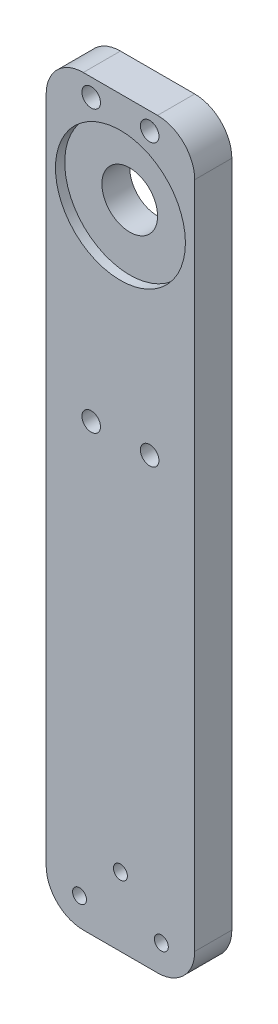
ISO-10303-21;
HEADER;
FILE_DESCRIPTION(('STEP AP214'),'2;1');
FILE_NAME('part.step','',(''),(''),'','','');
FILE_SCHEMA(('AUTOMOTIVE_DESIGN { 1 0 10303 214 1 1 1 1 }'));
ENDSEC;
DATA;
#1=APPLICATION_CONTEXT('core data for automotive mechanical design processes');
#2=APPLICATION_PROTOCOL_DEFINITION('international standard','automotive_design',2000,#1);
#3=PRODUCT_CONTEXT('',#1,'mechanical');
#4=PRODUCT('Part','Part','',(#3));
#5=PRODUCT_RELATED_PRODUCT_CATEGORY('part','',(#4));
#6=PRODUCT_DEFINITION_FORMATION('','',#4);
#7=PRODUCT_DEFINITION_CONTEXT('part definition',#1,'design');
#8=PRODUCT_DEFINITION('design','',#6,#7);
#9=PRODUCT_DEFINITION_SHAPE('','',#8);
#10=(LENGTH_UNIT() NAMED_UNIT(*) SI_UNIT(.MILLI.,.METRE.));
#11=(NAMED_UNIT(*) PLANE_ANGLE_UNIT() SI_UNIT($,.RADIAN.));
#12=(NAMED_UNIT(*) SI_UNIT($,.STERADIAN.) SOLID_ANGLE_UNIT());
#13=UNCERTAINTY_MEASURE_WITH_UNIT(LENGTH_MEASURE(1.E-05),#10,'distance_accuracy_value','');
#14=(GEOMETRIC_REPRESENTATION_CONTEXT(3) GLOBAL_UNCERTAINTY_ASSIGNED_CONTEXT((#13)) GLOBAL_UNIT_ASSIGNED_CONTEXT((#10,
#11,#12)) REPRESENTATION_CONTEXT('',''));
#15=CARTESIAN_POINT('',(0.,0.,0.));
#16=DIRECTION('',(0.,0.,1.));
#17=DIRECTION('',(1.,0.,0.));
#18=AXIS2_PLACEMENT_3D('',#15,#16,#17);
#19=CARTESIAN_POINT('',(12.7,110.499906,-13.4703841816037));
#20=DIRECTION('',(0.,0.,1.));
#21=DIRECTION('',(1.,0.,0.));
#22=AXIS2_PLACEMENT_3D('',#19,#20,#21);
#23=CYLINDRICAL_SURFACE('',#22,4.7625);
#24=CARTESIAN_POINT('',(12.7,110.499906,0.));
#25=DIRECTION('',(0.,0.,-1.));
#26=DIRECTION('',(-1.,0.,0.));
#27=AXIS2_PLACEMENT_3D('',#24,#25,#26);
#28=CIRCLE('',#27,4.7625);
#29=CARTESIAN_POINT('',(7.9375,110.499906,0.));
#30=VERTEX_POINT('',#29);
#31=EDGE_CURVE('E191',#30,#30,#28,.F.);
#32=ORIENTED_EDGE('',*,*,#31,.F.);
#33=EDGE_LOOP('',(#32));
#34=FACE_BOUND('',#33,.T.);
#35=CARTESIAN_POINT('',(12.7,110.499906,4.7625));
#36=DIRECTION('',(0.,0.,1.));
#37=DIRECTION('',(1.,0.,0.));
#38=AXIS2_PLACEMENT_3D('',#35,#36,#37);
#39=CIRCLE('',#38,4.7625);
#40=CARTESIAN_POINT('',(17.4625,110.499906,4.7625));
#41=VERTEX_POINT('',#40);
#42=EDGE_CURVE('E36',#41,#41,#39,.F.);
#43=ORIENTED_EDGE('',*,*,#42,.F.);
#44=EDGE_LOOP('',(#43));
#45=FACE_BOUND('',#44,.T.);
#46=ADVANCED_FACE('F32',(#34,#45),#23,.F.);
#47=CARTESIAN_POINT('',(0.,0.,6.35));
#48=DIRECTION('',(1.,0.,0.));
#49=DIRECTION('',(0.,0.,-1.));
#50=AXIS2_PLACEMENT_3D('',#47,#48,#49);
#51=PLANE('',#50);
#52=DIRECTION('',(0.,-1.,0.));
#53=VECTOR('',#52,1.);
#54=CARTESIAN_POINT('',(0.,0.,6.35));
#55=LINE('',#54,#53);
#56=CARTESIAN_POINT('',(0.,120.65,6.35));
#57=VERTEX_POINT('',#56);
#58=CARTESIAN_POINT('',(0.,6.35,6.35));
#59=VERTEX_POINT('',#58);
#60=EDGE_CURVE('E135',#57,#59,#55,.T.);
#61=ORIENTED_EDGE('',*,*,#60,.F.);
#62=DIRECTION('',(0.,0.,-1.));
#63=VECTOR('',#62,1.);
#64=CARTESIAN_POINT('',(0.,120.65,6.35));
#65=LINE('',#64,#63);
#66=CARTESIAN_POINT('',(0.,120.65,0.));
#67=VERTEX_POINT('',#66);
#68=EDGE_CURVE('E147',#57,#67,#65,.T.);
#69=ORIENTED_EDGE('',*,*,#68,.T.);
#70=DIRECTION('',(0.,-1.,0.));
#71=VECTOR('',#70,1.);
#72=CARTESIAN_POINT('',(0.,0.,0.));
#73=LINE('',#72,#71);
#74=CARTESIAN_POINT('',(0.,6.35,0.));
#75=VERTEX_POINT('',#74);
#76=EDGE_CURVE('E126',#67,#75,#73,.T.);
#77=ORIENTED_EDGE('',*,*,#76,.T.);
#78=DIRECTION('',(0.,0.,-1.));
#79=VECTOR('',#78,1.);
#80=CARTESIAN_POINT('',(0.,6.35,6.35));
#81=LINE('',#80,#79);
#82=EDGE_CURVE('E107',#75,#59,#81,.F.);
#83=ORIENTED_EDGE('',*,*,#82,.T.);
#84=EDGE_LOOP('',(#61,#69,#77,#83));
#85=FACE_BOUND('',#84,.T.);
#86=ADVANCED_FACE('F167',(#85),#51,.F.);
#87=CARTESIAN_POINT('',(0.,0.,6.35));
#88=DIRECTION('',(0.,1.,0.));
#89=DIRECTION('',(0.,0.,1.));
#90=AXIS2_PLACEMENT_3D('',#87,#88,#89);
#91=PLANE('',#90);
#92=DIRECTION('',(1.,0.,0.));
#93=VECTOR('',#92,1.);
#94=CARTESIAN_POINT('',(0.,0.,6.35));
#95=LINE('',#94,#93);
#96=CARTESIAN_POINT('',(6.35,0.,6.35));
#97=VERTEX_POINT('',#96);
#98=CARTESIAN_POINT('',(19.05,0.,6.35));
#99=VERTEX_POINT('',#98);
#100=EDGE_CURVE('E120',#97,#99,#95,.T.);
#101=ORIENTED_EDGE('',*,*,#100,.F.);
#102=DIRECTION('',(0.,0.,-1.));
#103=VECTOR('',#102,1.);
#104=CARTESIAN_POINT('',(6.35,0.,6.35));
#105=LINE('',#104,#103);
#106=CARTESIAN_POINT('',(6.35,0.,0.));
#107=VERTEX_POINT('',#106);
#108=EDGE_CURVE('E105',#97,#107,#105,.T.);
#109=ORIENTED_EDGE('',*,*,#108,.T.);
#110=DIRECTION('',(1.,0.,0.));
#111=VECTOR('',#110,1.);
#112=CARTESIAN_POINT('',(0.,0.,0.));
#113=LINE('',#112,#111);
#114=CARTESIAN_POINT('',(19.05,0.,0.));
#115=VERTEX_POINT('',#114);
#116=EDGE_CURVE('E117',#107,#115,#113,.T.);
#117=ORIENTED_EDGE('',*,*,#116,.T.);
#118=DIRECTION('',(0.,0.,-1.));
#119=VECTOR('',#118,1.);
#120=CARTESIAN_POINT('',(19.05,0.,6.35));
#121=LINE('',#120,#119);
#122=EDGE_CURVE('E121',#115,#99,#121,.F.);
#123=ORIENTED_EDGE('',*,*,#122,.T.);
#124=EDGE_LOOP('',(#101,#109,#117,#123));
#125=FACE_BOUND('',#124,.T.);
#126=ADVANCED_FACE('F116',(#125),#91,.F.);
#127=CARTESIAN_POINT('',(25.4,0.,6.35));
#128=DIRECTION('',(-1.,0.,0.));
#129=DIRECTION('',(0.,0.,1.));
#130=AXIS2_PLACEMENT_3D('',#127,#128,#129);
#131=PLANE('',#130);
#132=DIRECTION('',(0.,1.,0.));
#133=VECTOR('',#132,1.);
#134=CARTESIAN_POINT('',(25.4,0.,0.));
#135=LINE('',#134,#133);
#136=CARTESIAN_POINT('',(25.4,6.35,0.));
#137=VERTEX_POINT('',#136);
#138=CARTESIAN_POINT('',(25.4,120.65,0.));
#139=VERTEX_POINT('',#138);
#140=EDGE_CURVE('E125',#137,#139,#135,.T.);
#141=ORIENTED_EDGE('',*,*,#140,.T.);
#142=DIRECTION('',(0.,0.,-1.));
#143=VECTOR('',#142,1.);
#144=CARTESIAN_POINT('',(25.4,120.65,6.35));
#145=LINE('',#144,#143);
#146=CARTESIAN_POINT('',(25.4,120.65,6.35));
#147=VERTEX_POINT('',#146);
#148=EDGE_CURVE('E11',#139,#147,#145,.F.);
#149=ORIENTED_EDGE('',*,*,#148,.T.);
#150=DIRECTION('',(0.,1.,0.));
#151=VECTOR('',#150,1.);
#152=CARTESIAN_POINT('',(25.4,0.,6.35));
#153=LINE('',#152,#151);
#154=CARTESIAN_POINT('',(25.4,6.35,6.35));
#155=VERTEX_POINT('',#154);
#156=EDGE_CURVE('E177',#155,#147,#153,.T.);
#157=ORIENTED_EDGE('',*,*,#156,.F.);
#158=DIRECTION('',(0.,0.,-1.));
#159=VECTOR('',#158,1.);
#160=CARTESIAN_POINT('',(25.4,6.35,6.35));
#161=LINE('',#160,#159);
#162=EDGE_CURVE('E144',#155,#137,#161,.T.);
#163=ORIENTED_EDGE('',*,*,#162,.T.);
#164=EDGE_LOOP('',(#141,#149,#157,#163));
#165=FACE_BOUND('',#164,.T.);
#166=ADVANCED_FACE('F175',(#165),#131,.F.);
#167=CARTESIAN_POINT('',(0.,127.,6.35));
#168=DIRECTION('',(0.,-1.,0.));
#169=DIRECTION('',(0.,0.,-1.));
#170=AXIS2_PLACEMENT_3D('',#167,#168,#169);
#171=PLANE('',#170);
#172=DIRECTION('',(-1.,0.,0.));
#173=VECTOR('',#172,1.);
#174=CARTESIAN_POINT('',(0.,127.,0.));
#175=LINE('',#174,#173);
#176=CARTESIAN_POINT('',(19.05,127.,0.));
#177=VERTEX_POINT('',#176);
#178=CARTESIAN_POINT('',(6.35,127.,0.));
#179=VERTEX_POINT('',#178);
#180=EDGE_CURVE('E128',#177,#179,#175,.T.);
#181=ORIENTED_EDGE('',*,*,#180,.T.);
#182=DIRECTION('',(0.,0.,-1.));
#183=VECTOR('',#182,1.);
#184=CARTESIAN_POINT('',(6.35,127.,6.35));
#185=LINE('',#184,#183);
#186=CARTESIAN_POINT('',(6.35,127.,6.35));
#187=VERTEX_POINT('',#186);
#188=EDGE_CURVE('E54',#179,#187,#185,.F.);
#189=ORIENTED_EDGE('',*,*,#188,.T.);
#190=DIRECTION('',(-1.,0.,0.));
#191=VECTOR('',#190,1.);
#192=CARTESIAN_POINT('',(0.,127.,6.35));
#193=LINE('',#192,#191);
#194=CARTESIAN_POINT('',(19.05,127.,6.35));
#195=VERTEX_POINT('',#194);
#196=EDGE_CURVE('E136',#195,#187,#193,.T.);
#197=ORIENTED_EDGE('',*,*,#196,.F.);
#198=DIRECTION('',(0.,0.,-1.));
#199=VECTOR('',#198,1.);
#200=CARTESIAN_POINT('',(19.05,127.,6.35));
#201=LINE('',#200,#199);
#202=EDGE_CURVE('E154',#195,#177,#201,.T.);
#203=ORIENTED_EDGE('',*,*,#202,.T.);
#204=EDGE_LOOP('',(#181,#189,#197,#203));
#205=FACE_BOUND('',#204,.T.);
#206=ADVANCED_FACE('F171',(#205),#171,.F.);
#207=CARTESIAN_POINT('',(0.,0.,6.35));
#208=DIRECTION('',(0.,0.,-1.));
#209=DIRECTION('',(-1.,0.,0.));
#210=AXIS2_PLACEMENT_3D('',#207,#208,#209);
#211=PLANE('',#210);
#212=CARTESIAN_POINT('',(7.7,124.,6.35));
#213=DIRECTION('',(0.,0.,1.));
#214=DIRECTION('',(1.,0.,0.));
#215=AXIS2_PLACEMENT_3D('',#212,#213,#214);
#216=CIRCLE('',#215,1.5875);
#217=CARTESIAN_POINT('',(9.2875,124.,6.35));
#218=VERTEX_POINT('',#217);
#219=EDGE_CURVE('E220',#218,#218,#216,.T.);
#220=ORIENTED_EDGE('',*,*,#219,.F.);
#221=EDGE_LOOP('',(#220));
#222=FACE_BOUND('',#221,.T.);
#223=CARTESIAN_POINT('',(17.7,76.,6.35));
#224=DIRECTION('',(0.,0.,1.));
#225=DIRECTION('',(1.,0.,0.));
#226=AXIS2_PLACEMENT_3D('',#223,#224,#225);
#227=CIRCLE('',#226,1.5875);
#228=CARTESIAN_POINT('',(19.2875,76.,6.35));
#229=VERTEX_POINT('',#228);
#230=EDGE_CURVE('E221',#229,#229,#227,.T.);
#231=ORIENTED_EDGE('',*,*,#230,.F.);
#232=EDGE_LOOP('',(#231));
#233=FACE_BOUND('',#232,.T.);
#234=CARTESIAN_POINT('',(7.7,76.,6.35));
#235=DIRECTION('',(0.,0.,1.));
#236=DIRECTION('',(1.,0.,0.));
#237=AXIS2_PLACEMENT_3D('',#234,#235,#236);
#238=CIRCLE('',#237,1.5875);
#239=CARTESIAN_POINT('',(9.2875,76.,6.35));
#240=VERTEX_POINT('',#239);
#241=EDGE_CURVE('E231',#240,#240,#238,.T.);
#242=ORIENTED_EDGE('',*,*,#241,.F.);
#243=EDGE_LOOP('',(#242));
#244=FACE_BOUND('',#243,.T.);
#245=CARTESIAN_POINT('',(17.7,124.,6.35));
#246=DIRECTION('',(0.,0.,1.));
#247=DIRECTION('',(1.,0.,0.));
#248=AXIS2_PLACEMENT_3D('',#245,#246,#247);
#249=CIRCLE('',#248,1.5875);
#250=CARTESIAN_POINT('',(19.2875,124.,6.35));
#251=VERTEX_POINT('',#250);
#252=EDGE_CURVE('E213',#251,#251,#249,.T.);
#253=ORIENTED_EDGE('',*,*,#252,.F.);
#254=EDGE_LOOP('',(#253));
#255=FACE_BOUND('',#254,.T.);
#256=CARTESIAN_POINT('',(12.7,110.499906,6.35));
#257=DIRECTION('',(0.,0.,1.));
#258=DIRECTION('',(1.,0.,0.));
#259=AXIS2_PLACEMENT_3D('',#256,#257,#258);
#260=CIRCLE('',#259,11.1125);
#261=CARTESIAN_POINT('',(23.8125,110.499906,6.35));
#262=VERTEX_POINT('',#261);
#263=EDGE_CURVE('E204',#262,#262,#260,.T.);
#264=ORIENTED_EDGE('',*,*,#263,.F.);
#265=EDGE_LOOP('',(#264));
#266=FACE_BOUND('',#265,.T.);
#267=CARTESIAN_POINT('',(5.7,4.7625,6.35));
#268=DIRECTION('',(0.,0.,1.));
#269=DIRECTION('',(1.,0.,0.));
#270=AXIS2_PLACEMENT_3D('',#267,#268,#269);
#271=CIRCLE('',#270,1.190625);
#272=CARTESIAN_POINT('',(6.890625,4.7625,6.35));
#273=VERTEX_POINT('',#272);
#274=EDGE_CURVE('E195',#273,#273,#271,.T.);
#275=ORIENTED_EDGE('',*,*,#274,.F.);
#276=EDGE_LOOP('',(#275));
#277=FACE_BOUND('',#276,.T.);
#278=CARTESIAN_POINT('',(19.7,4.7625,6.35));
#279=DIRECTION('',(0.,0.,1.));
#280=DIRECTION('',(1.,0.,0.));
#281=AXIS2_PLACEMENT_3D('',#278,#279,#280);
#282=CIRCLE('',#281,1.190625);
#283=CARTESIAN_POINT('',(20.890625,4.7625,6.35));
#284=VERTEX_POINT('',#283);
#285=EDGE_CURVE('E187',#284,#284,#282,.T.);
#286=ORIENTED_EDGE('',*,*,#285,.F.);
#287=EDGE_LOOP('',(#286));
#288=FACE_BOUND('',#287,.T.);
#289=CARTESIAN_POINT('',(12.7,11.7625,6.35));
#290=DIRECTION('',(0.,0.,1.));
#291=DIRECTION('',(1.,0.,0.));
#292=AXIS2_PLACEMENT_3D('',#289,#290,#291);
#293=CIRCLE('',#292,1.190625);
#294=CARTESIAN_POINT('',(13.890625,11.7625,6.35));
#295=VERTEX_POINT('',#294);
#296=EDGE_CURVE('E188',#295,#295,#293,.T.);
#297=ORIENTED_EDGE('',*,*,#296,.F.);
#298=EDGE_LOOP('',(#297));
#299=FACE_BOUND('',#298,.T.);
#300=ORIENTED_EDGE('',*,*,#196,.T.);
#301=CARTESIAN_POINT('',(6.35,120.65,6.35));
#302=DIRECTION('',(0.,0.,-1.));
#303=DIRECTION('',(-1.,0.,0.));
#304=AXIS2_PLACEMENT_3D('',#301,#302,#303);
#305=CIRCLE('',#304,6.35);
#306=EDGE_CURVE('E41',#187,#57,#305,.F.);
#307=ORIENTED_EDGE('',*,*,#306,.T.);
#308=ORIENTED_EDGE('',*,*,#60,.T.);
#309=CARTESIAN_POINT('',(6.35,6.35,6.35));
#310=DIRECTION('',(0.,0.,-1.));
#311=DIRECTION('',(-1.,0.,0.));
#312=AXIS2_PLACEMENT_3D('',#309,#310,#311);
#313=CIRCLE('',#312,6.35);
#314=EDGE_CURVE('E142',#59,#97,#313,.F.);
#315=ORIENTED_EDGE('',*,*,#314,.T.);
#316=ORIENTED_EDGE('',*,*,#100,.T.);
#317=CARTESIAN_POINT('',(19.05,6.35,6.35));
#318=DIRECTION('',(0.,0.,-1.));
#319=DIRECTION('',(-1.,0.,0.));
#320=AXIS2_PLACEMENT_3D('',#317,#318,#319);
#321=CIRCLE('',#320,6.35);
#322=EDGE_CURVE('E140',#99,#155,#321,.F.);
#323=ORIENTED_EDGE('',*,*,#322,.T.);
#324=ORIENTED_EDGE('',*,*,#156,.T.);
#325=CARTESIAN_POINT('',(19.05,120.65,6.35));
#326=DIRECTION('',(0.,0.,-1.));
#327=DIRECTION('',(-1.,0.,0.));
#328=AXIS2_PLACEMENT_3D('',#325,#326,#327);
#329=CIRCLE('',#328,6.35);
#330=EDGE_CURVE('E158',#147,#195,#329,.F.);
#331=ORIENTED_EDGE('',*,*,#330,.T.);
#332=EDGE_LOOP('',(#300,#307,#308,#315,#316,#323,#324,#331));
#333=FACE_BOUND('',#332,.T.);
#334=ADVANCED_FACE('F163',(#222,#233,#244,#255,#266,#277,#288,#299,#333),#211,.F.);
#335=CARTESIAN_POINT('',(0.,0.,0.));
#336=DIRECTION('',(0.,0.,-1.));
#337=DIRECTION('',(-1.,0.,0.));
#338=AXIS2_PLACEMENT_3D('',#335,#336,#337);
#339=PLANE('',#338);
#340=CARTESIAN_POINT('',(7.7,124.,0.));
#341=DIRECTION('',(0.,0.,-1.));
#342=DIRECTION('',(-1.,0.,0.));
#343=AXIS2_PLACEMENT_3D('',#340,#341,#342);
#344=CIRCLE('',#343,1.5875);
#345=CARTESIAN_POINT('',(6.1125,124.,0.));
#346=VERTEX_POINT('',#345);
#347=EDGE_CURVE('E216',#346,#346,#344,.F.);
#348=ORIENTED_EDGE('',*,*,#347,.T.);
#349=EDGE_LOOP('',(#348));
#350=FACE_BOUND('',#349,.T.);
#351=CARTESIAN_POINT('',(17.7,76.,0.));
#352=DIRECTION('',(0.,0.,-1.));
#353=DIRECTION('',(-1.,0.,0.));
#354=AXIS2_PLACEMENT_3D('',#351,#352,#353);
#355=CIRCLE('',#354,1.5875);
#356=CARTESIAN_POINT('',(16.1125,76.,0.));
#357=VERTEX_POINT('',#356);
#358=EDGE_CURVE('E217',#357,#357,#355,.F.);
#359=ORIENTED_EDGE('',*,*,#358,.T.);
#360=EDGE_LOOP('',(#359));
#361=FACE_BOUND('',#360,.T.);
#362=CARTESIAN_POINT('',(7.7,76.,0.));
#363=DIRECTION('',(0.,0.,-1.));
#364=DIRECTION('',(-1.,0.,0.));
#365=AXIS2_PLACEMENT_3D('',#362,#363,#364);
#366=CIRCLE('',#365,1.5875);
#367=CARTESIAN_POINT('',(6.1125,76.,0.));
#368=VERTEX_POINT('',#367);
#369=EDGE_CURVE('E224',#368,#368,#366,.F.);
#370=ORIENTED_EDGE('',*,*,#369,.T.);
#371=EDGE_LOOP('',(#370));
#372=FACE_BOUND('',#371,.T.);
#373=CARTESIAN_POINT('',(17.7,124.,0.));
#374=DIRECTION('',(0.,0.,-1.));
#375=DIRECTION('',(-1.,0.,0.));
#376=AXIS2_PLACEMENT_3D('',#373,#374,#375);
#377=CIRCLE('',#376,1.5875);
#378=CARTESIAN_POINT('',(16.1125,124.,0.));
#379=VERTEX_POINT('',#378);
#380=EDGE_CURVE('E208',#379,#379,#377,.F.);
#381=ORIENTED_EDGE('',*,*,#380,.T.);
#382=EDGE_LOOP('',(#381));
#383=FACE_BOUND('',#382,.T.);
#384=ORIENTED_EDGE('',*,*,#31,.T.);
#385=EDGE_LOOP('',(#384));
#386=FACE_BOUND('',#385,.T.);
#387=CARTESIAN_POINT('',(5.7,4.7625,0.));
#388=DIRECTION('',(0.,0.,-1.));
#389=DIRECTION('',(-1.,0.,0.));
#390=AXIS2_PLACEMENT_3D('',#387,#388,#389);
#391=CIRCLE('',#390,1.190625);
#392=CARTESIAN_POINT('',(4.509375,4.7625,0.));
#393=VERTEX_POINT('',#392);
#394=EDGE_CURVE('E130',#393,#393,#391,.F.);
#395=ORIENTED_EDGE('',*,*,#394,.T.);
#396=EDGE_LOOP('',(#395));
#397=FACE_BOUND('',#396,.T.);
#398=CARTESIAN_POINT('',(19.7,4.7625,0.));
#399=DIRECTION('',(0.,0.,-1.));
#400=DIRECTION('',(-1.,0.,0.));
#401=AXIS2_PLACEMENT_3D('',#398,#399,#400);
#402=CIRCLE('',#401,1.190625);
#403=CARTESIAN_POINT('',(18.509375,4.7625,0.));
#404=VERTEX_POINT('',#403);
#405=EDGE_CURVE('E192',#404,#404,#402,.F.);
#406=ORIENTED_EDGE('',*,*,#405,.T.);
#407=EDGE_LOOP('',(#406));
#408=FACE_BOUND('',#407,.T.);
#409=CARTESIAN_POINT('',(12.7,11.7625,0.));
#410=DIRECTION('',(0.,0.,-1.));
#411=DIRECTION('',(-1.,0.,0.));
#412=AXIS2_PLACEMENT_3D('',#409,#410,#411);
#413=CIRCLE('',#412,1.190625);
#414=CARTESIAN_POINT('',(11.509375,11.7625,0.));
#415=VERTEX_POINT('',#414);
#416=EDGE_CURVE('E184',#415,#415,#413,.F.);
#417=ORIENTED_EDGE('',*,*,#416,.T.);
#418=EDGE_LOOP('',(#417));
#419=FACE_BOUND('',#418,.T.);
#420=ORIENTED_EDGE('',*,*,#76,.F.);
#421=CARTESIAN_POINT('',(6.35,120.65,0.));
#422=DIRECTION('',(0.,0.,-1.));
#423=DIRECTION('',(-1.,0.,0.));
#424=AXIS2_PLACEMENT_3D('',#421,#422,#423);
#425=CIRCLE('',#424,6.35);
#426=EDGE_CURVE('E152',#67,#179,#425,.T.);
#427=ORIENTED_EDGE('',*,*,#426,.T.);
#428=ORIENTED_EDGE('',*,*,#180,.F.);
#429=CARTESIAN_POINT('',(19.05,120.65,0.));
#430=DIRECTION('',(0.,0.,-1.));
#431=DIRECTION('',(-1.,0.,0.));
#432=AXIS2_PLACEMENT_3D('',#429,#430,#431);
#433=CIRCLE('',#432,6.35);
#434=EDGE_CURVE('E150',#177,#139,#433,.T.);
#435=ORIENTED_EDGE('',*,*,#434,.T.);
#436=ORIENTED_EDGE('',*,*,#140,.F.);
#437=CARTESIAN_POINT('',(19.05,6.35,0.));
#438=DIRECTION('',(0.,0.,-1.));
#439=DIRECTION('',(-1.,0.,0.));
#440=AXIS2_PLACEMENT_3D('',#437,#438,#439);
#441=CIRCLE('',#440,6.35);
#442=EDGE_CURVE('E111',#137,#115,#441,.T.);
#443=ORIENTED_EDGE('',*,*,#442,.T.);
#444=ORIENTED_EDGE('',*,*,#116,.F.);
#445=CARTESIAN_POINT('',(6.35,6.35,0.));
#446=DIRECTION('',(0.,0.,-1.));
#447=DIRECTION('',(-1.,0.,0.));
#448=AXIS2_PLACEMENT_3D('',#445,#446,#447);
#449=CIRCLE('',#448,6.35);
#450=EDGE_CURVE('E101',#107,#75,#449,.T.);
#451=ORIENTED_EDGE('',*,*,#450,.T.);
#452=EDGE_LOOP('',(#420,#427,#428,#435,#436,#443,#444,#451));
#453=FACE_BOUND('',#452,.T.);
#454=ADVANCED_FACE('F123',(#350,#361,#372,#383,#386,#397,#408,#419,#453),#339,.T.);
#455=CARTESIAN_POINT('',(12.7,11.7625,-3.36759604540093));
#456=DIRECTION('',(0.,0.,1.));
#457=DIRECTION('',(1.,0.,0.));
#458=AXIS2_PLACEMENT_3D('',#455,#456,#457);
#459=CYLINDRICAL_SURFACE('',#458,1.190625);
#460=ORIENTED_EDGE('',*,*,#296,.T.);
#461=EDGE_LOOP('',(#460));
#462=FACE_BOUND('',#461,.T.);
#463=ORIENTED_EDGE('',*,*,#416,.F.);
#464=EDGE_LOOP('',(#463));
#465=FACE_BOUND('',#464,.T.);
#466=ADVANCED_FACE('F252',(#462,#465),#459,.F.);
#467=CARTESIAN_POINT('',(19.7,4.7625,-3.36759604540093));
#468=DIRECTION('',(0.,0.,1.));
#469=DIRECTION('',(1.,0.,0.));
#470=AXIS2_PLACEMENT_3D('',#467,#468,#469);
#471=CYLINDRICAL_SURFACE('',#470,1.190625);
#472=ORIENTED_EDGE('',*,*,#285,.T.);
#473=EDGE_LOOP('',(#472));
#474=FACE_BOUND('',#473,.T.);
#475=ORIENTED_EDGE('',*,*,#405,.F.);
#476=EDGE_LOOP('',(#475));
#477=FACE_BOUND('',#476,.T.);
#478=ADVANCED_FACE('F255',(#474,#477),#471,.F.);
#479=CARTESIAN_POINT('',(5.7,4.7625,-3.36759604540093));
#480=DIRECTION('',(0.,0.,1.));
#481=DIRECTION('',(1.,0.,0.));
#482=AXIS2_PLACEMENT_3D('',#479,#480,#481);
#483=CYLINDRICAL_SURFACE('',#482,1.190625);
#484=ORIENTED_EDGE('',*,*,#274,.T.);
#485=EDGE_LOOP('',(#484));
#486=FACE_BOUND('',#485,.T.);
#487=ORIENTED_EDGE('',*,*,#394,.F.);
#488=EDGE_LOOP('',(#487));
#489=FACE_BOUND('',#488,.T.);
#490=ADVANCED_FACE('F279',(#486,#489),#483,.F.);
#491=CARTESIAN_POINT('',(6.35,6.35,6.35));
#492=DIRECTION('',(0.,0.,-1.));
#493=DIRECTION('',(-1.,0.,0.));
#494=AXIS2_PLACEMENT_3D('',#491,#492,#493);
#495=CYLINDRICAL_SURFACE('',#494,6.35);
#496=ORIENTED_EDGE('',*,*,#314,.F.);
#497=ORIENTED_EDGE('',*,*,#82,.F.);
#498=ORIENTED_EDGE('',*,*,#450,.F.);
#499=ORIENTED_EDGE('',*,*,#108,.F.);
#500=EDGE_LOOP('',(#496,#497,#498,#499));
#501=FACE_BOUND('',#500,.T.);
#502=ADVANCED_FACE('F104',(#501),#495,.T.);
#503=CARTESIAN_POINT('',(19.05,6.35,6.35));
#504=DIRECTION('',(0.,0.,-1.));
#505=DIRECTION('',(-1.,0.,0.));
#506=AXIS2_PLACEMENT_3D('',#503,#504,#505);
#507=CYLINDRICAL_SURFACE('',#506,6.35);
#508=ORIENTED_EDGE('',*,*,#322,.F.);
#509=ORIENTED_EDGE('',*,*,#122,.F.);
#510=ORIENTED_EDGE('',*,*,#442,.F.);
#511=ORIENTED_EDGE('',*,*,#162,.F.);
#512=EDGE_LOOP('',(#508,#509,#510,#511));
#513=FACE_BOUND('',#512,.T.);
#514=ADVANCED_FACE('F180',(#513),#507,.T.);
#515=CARTESIAN_POINT('',(6.35,120.65,6.35));
#516=DIRECTION('',(0.,0.,-1.));
#517=DIRECTION('',(-1.,0.,0.));
#518=AXIS2_PLACEMENT_3D('',#515,#516,#517);
#519=CYLINDRICAL_SURFACE('',#518,6.35);
#520=ORIENTED_EDGE('',*,*,#306,.F.);
#521=ORIENTED_EDGE('',*,*,#188,.F.);
#522=ORIENTED_EDGE('',*,*,#426,.F.);
#523=ORIENTED_EDGE('',*,*,#68,.F.);
#524=EDGE_LOOP('',(#520,#521,#522,#523));
#525=FACE_BOUND('',#524,.T.);
#526=ADVANCED_FACE('F169',(#525),#519,.T.);
#527=CARTESIAN_POINT('',(19.05,120.65,6.35));
#528=DIRECTION('',(0.,0.,-1.));
#529=DIRECTION('',(-1.,0.,0.));
#530=AXIS2_PLACEMENT_3D('',#527,#528,#529);
#531=CYLINDRICAL_SURFACE('',#530,6.35);
#532=ORIENTED_EDGE('',*,*,#330,.F.);
#533=ORIENTED_EDGE('',*,*,#148,.F.);
#534=ORIENTED_EDGE('',*,*,#434,.F.);
#535=ORIENTED_EDGE('',*,*,#202,.F.);
#536=EDGE_LOOP('',(#532,#533,#534,#535));
#537=FACE_BOUND('',#536,.T.);
#538=ADVANCED_FACE('F34',(#537),#531,.T.);
#539=CARTESIAN_POINT('',(12.7,110.499906,4.7625));
#540=DIRECTION('',(0.,0.,1.));
#541=DIRECTION('',(1.,0.,0.));
#542=AXIS2_PLACEMENT_3D('',#539,#540,#541);
#543=PLANE('',#542);
#544=CARTESIAN_POINT('',(12.7,110.499906,4.7625));
#545=DIRECTION('',(0.,0.,1.));
#546=DIRECTION('',(1.,0.,0.));
#547=AXIS2_PLACEMENT_3D('',#544,#545,#546);
#548=CIRCLE('',#547,11.1125);
#549=CARTESIAN_POINT('',(23.8125,110.499906,4.7625));
#550=VERTEX_POINT('',#549);
#551=EDGE_CURVE('E207',#550,#550,#548,.T.);
#552=ORIENTED_EDGE('',*,*,#551,.T.);
#553=EDGE_LOOP('',(#552));
#554=FACE_BOUND('',#553,.T.);
#555=ORIENTED_EDGE('',*,*,#42,.T.);
#556=EDGE_LOOP('',(#555));
#557=FACE_BOUND('',#556,.T.);
#558=ADVANCED_FACE('F322',(#554,#557),#543,.T.);
#559=CARTESIAN_POINT('',(12.7,110.499906,4.7625));
#560=DIRECTION('',(0.,0.,1.));
#561=DIRECTION('',(1.,0.,0.));
#562=AXIS2_PLACEMENT_3D('',#559,#560,#561);
#563=CYLINDRICAL_SURFACE('',#562,11.1125);
#564=ORIENTED_EDGE('',*,*,#551,.F.);
#565=EDGE_LOOP('',(#564));
#566=FACE_BOUND('',#565,.T.);
#567=ORIENTED_EDGE('',*,*,#263,.T.);
#568=EDGE_LOOP('',(#567));
#569=FACE_BOUND('',#568,.T.);
#570=ADVANCED_FACE('F277',(#566,#569),#563,.F.);
#571=CARTESIAN_POINT('',(17.7,124.,-4.49012806053459));
#572=DIRECTION('',(0.,0.,1.));
#573=DIRECTION('',(1.,0.,0.));
#574=AXIS2_PLACEMENT_3D('',#571,#572,#573);
#575=CYLINDRICAL_SURFACE('',#574,1.5875);
#576=ORIENTED_EDGE('',*,*,#252,.T.);
#577=EDGE_LOOP('',(#576));
#578=FACE_BOUND('',#577,.T.);
#579=ORIENTED_EDGE('',*,*,#380,.F.);
#580=EDGE_LOOP('',(#579));
#581=FACE_BOUND('',#580,.T.);
#582=ADVANCED_FACE('F334',(#578,#581),#575,.F.);
#583=CARTESIAN_POINT('',(7.7,76.,-4.49012806053459));
#584=DIRECTION('',(0.,0.,1.));
#585=DIRECTION('',(1.,0.,0.));
#586=AXIS2_PLACEMENT_3D('',#583,#584,#585);
#587=CYLINDRICAL_SURFACE('',#586,1.5875);
#588=ORIENTED_EDGE('',*,*,#241,.T.);
#589=EDGE_LOOP('',(#588));
#590=FACE_BOUND('',#589,.T.);
#591=ORIENTED_EDGE('',*,*,#369,.F.);
#592=EDGE_LOOP('',(#591));
#593=FACE_BOUND('',#592,.T.);
#594=ADVANCED_FACE('F235',(#590,#593),#587,.F.);
#595=CARTESIAN_POINT('',(17.7,76.,-4.49012806053459));
#596=DIRECTION('',(0.,0.,1.));
#597=DIRECTION('',(1.,0.,0.));
#598=AXIS2_PLACEMENT_3D('',#595,#596,#597);
#599=CYLINDRICAL_SURFACE('',#598,1.5875);
#600=ORIENTED_EDGE('',*,*,#230,.T.);
#601=EDGE_LOOP('',(#600));
#602=FACE_BOUND('',#601,.T.);
#603=ORIENTED_EDGE('',*,*,#358,.F.);
#604=EDGE_LOOP('',(#603));
#605=FACE_BOUND('',#604,.T.);
#606=ADVANCED_FACE('F349',(#602,#605),#599,.F.);
#607=CARTESIAN_POINT('',(7.7,124.,-4.49012806053459));
#608=DIRECTION('',(0.,0.,1.));
#609=DIRECTION('',(1.,0.,0.));
#610=AXIS2_PLACEMENT_3D('',#607,#608,#609);
#611=CYLINDRICAL_SURFACE('',#610,1.5875);
#612=ORIENTED_EDGE('',*,*,#219,.T.);
#613=EDGE_LOOP('',(#612));
#614=FACE_BOUND('',#613,.T.);
#615=ORIENTED_EDGE('',*,*,#347,.F.);
#616=EDGE_LOOP('',(#615));
#617=FACE_BOUND('',#616,.T.);
#618=ADVANCED_FACE('F356',(#614,#617),#611,.F.);
#619=CLOSED_SHELL('',(#46,#86,#126,#166,#206,#334,#454,#466,#478,#490,#502,#514,#526,#538,#558,
#570,#582,#594,#606,#618));
#620=MANIFOLD_SOLID_BREP('B2',#619);
#621=ADVANCED_BREP_SHAPE_REPRESENTATION('',(#18,#620),#14);
#622=SHAPE_DEFINITION_REPRESENTATION(#9,#621);
ENDSEC;
END-ISO-10303-21;
